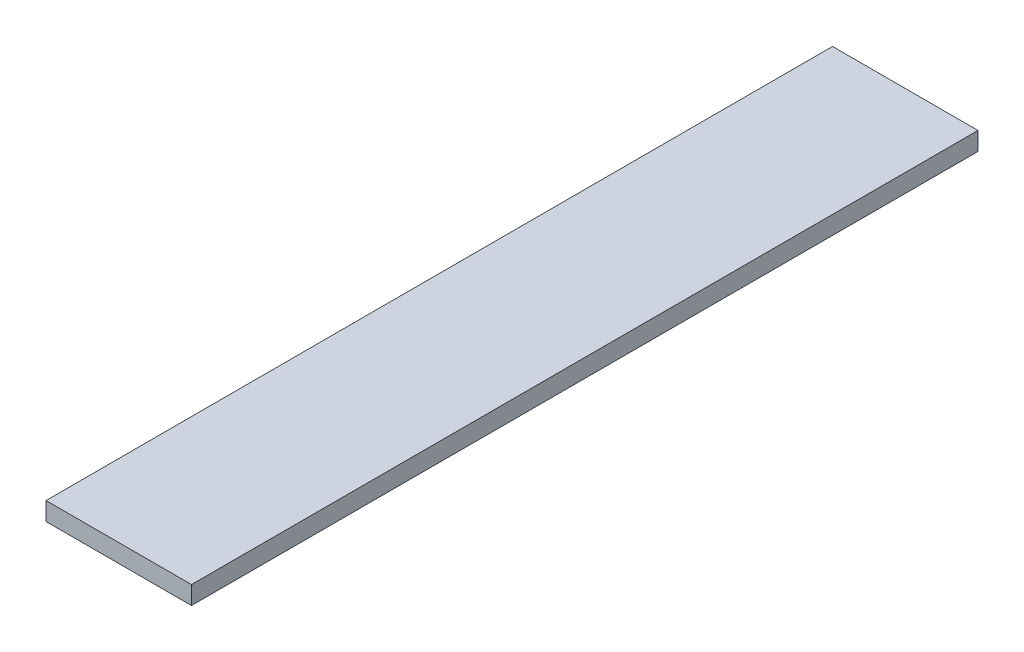
ISO-10303-21;
HEADER;
FILE_DESCRIPTION(('STEP AP214'),'2;1');
FILE_NAME('part.step','',(''),(''),'','','');
FILE_SCHEMA(('AUTOMOTIVE_DESIGN { 1 0 10303 214 1 1 1 1 }'));
ENDSEC;
DATA;
#1=APPLICATION_CONTEXT('core data for automotive mechanical design processes');
#2=APPLICATION_PROTOCOL_DEFINITION('international standard','automotive_design',2000,#1);
#3=PRODUCT_CONTEXT('',#1,'mechanical');
#4=PRODUCT('Part','Part','',(#3));
#5=PRODUCT_RELATED_PRODUCT_CATEGORY('part','',(#4));
#6=PRODUCT_DEFINITION_FORMATION('','',#4);
#7=PRODUCT_DEFINITION_CONTEXT('part definition',#1,'design');
#8=PRODUCT_DEFINITION('design','',#6,#7);
#9=PRODUCT_DEFINITION_SHAPE('','',#8);
#10=(LENGTH_UNIT() NAMED_UNIT(*) SI_UNIT(.MILLI.,.METRE.));
#11=(NAMED_UNIT(*) PLANE_ANGLE_UNIT() SI_UNIT($,.RADIAN.));
#12=(NAMED_UNIT(*) SI_UNIT($,.STERADIAN.) SOLID_ANGLE_UNIT());
#13=UNCERTAINTY_MEASURE_WITH_UNIT(LENGTH_MEASURE(1.E-05),#10,'distance_accuracy_value','');
#14=(GEOMETRIC_REPRESENTATION_CONTEXT(3) GLOBAL_UNCERTAINTY_ASSIGNED_CONTEXT((#13)) GLOBAL_UNIT_ASSIGNED_CONTEXT((#10,
#11,#12)) REPRESENTATION_CONTEXT('',''));
#15=CARTESIAN_POINT('',(0.,0.,0.));
#16=DIRECTION('',(0.,0.,1.));
#17=DIRECTION('',(1.,0.,0.));
#18=AXIS2_PLACEMENT_3D('',#15,#16,#17);
#19=CARTESIAN_POINT('',(101.6,12.7,0.));
#20=DIRECTION('',(0.,1.,0.));
#21=DIRECTION('',(0.,0.,1.));
#22=AXIS2_PLACEMENT_3D('',#19,#20,#21);
#23=PLANE('',#22);
#24=DIRECTION('',(0.,0.,-1.));
#25=VECTOR('',#24,1.);
#26=CARTESIAN_POINT('',(101.6,12.7,0.));
#27=LINE('',#26,#25);
#28=CARTESIAN_POINT('',(101.6,12.7,0.));
#29=VERTEX_POINT('',#28);
#30=CARTESIAN_POINT('',(101.6,12.7,549.275));
#31=VERTEX_POINT('',#30);
#32=EDGE_CURVE('E19',#29,#31,#27,.F.);
#33=ORIENTED_EDGE('',*,*,#32,.F.);
#34=DIRECTION('',(1.,0.,0.));
#35=VECTOR('',#34,1.);
#36=CARTESIAN_POINT('',(0.,12.7,0.));
#37=LINE('',#36,#35);
#38=CARTESIAN_POINT('',(0.,12.7,0.));
#39=VERTEX_POINT('',#38);
#40=EDGE_CURVE('E79',#29,#39,#37,.F.);
#41=ORIENTED_EDGE('',*,*,#40,.T.);
#42=DIRECTION('',(0.,0.,1.));
#43=VECTOR('',#42,1.);
#44=CARTESIAN_POINT('',(0.,12.7,0.));
#45=LINE('',#44,#43);
#46=CARTESIAN_POINT('',(0.,12.7,549.275));
#47=VERTEX_POINT('',#46);
#48=EDGE_CURVE('E67',#47,#39,#45,.F.);
#49=ORIENTED_EDGE('',*,*,#48,.F.);
#50=DIRECTION('',(1.,0.,0.));
#51=VECTOR('',#50,1.);
#52=CARTESIAN_POINT('',(0.,12.7,549.275));
#53=LINE('',#52,#51);
#54=EDGE_CURVE('E55',#31,#47,#53,.F.);
#55=ORIENTED_EDGE('',*,*,#54,.F.);
#56=EDGE_LOOP('',(#33,#41,#49,#55));
#57=FACE_BOUND('',#56,.T.);
#58=ADVANCED_FACE('F16',(#57),#23,.T.);
#59=CARTESIAN_POINT('',(101.6,0.,0.));
#60=DIRECTION('',(1.,0.,0.));
#61=DIRECTION('',(0.,0.,-1.));
#62=AXIS2_PLACEMENT_3D('',#59,#60,#61);
#63=PLANE('',#62);
#64=DIRECTION('',(0.,0.,-1.));
#65=VECTOR('',#64,1.);
#66=CARTESIAN_POINT('',(101.6,0.,0.));
#67=LINE('',#66,#65);
#68=CARTESIAN_POINT('',(101.6,0.,0.));
#69=VERTEX_POINT('',#68);
#70=CARTESIAN_POINT('',(101.6,0.,549.275));
#71=VERTEX_POINT('',#70);
#72=EDGE_CURVE('E82',#69,#71,#67,.F.);
#73=ORIENTED_EDGE('',*,*,#72,.F.);
#74=DIRECTION('',(0.,1.,0.));
#75=VECTOR('',#74,1.);
#76=CARTESIAN_POINT('',(101.6,0.,0.));
#77=LINE('',#76,#75);
#78=EDGE_CURVE('E64',#69,#29,#77,.T.);
#79=ORIENTED_EDGE('',*,*,#78,.T.);
#80=ORIENTED_EDGE('',*,*,#32,.T.);
#81=DIRECTION('',(0.,1.,0.));
#82=VECTOR('',#81,1.);
#83=CARTESIAN_POINT('',(101.6,0.,549.275));
#84=LINE('',#83,#82);
#85=EDGE_CURVE('E61',#71,#31,#84,.T.);
#86=ORIENTED_EDGE('',*,*,#85,.F.);
#87=EDGE_LOOP('',(#73,#79,#80,#86));
#88=FACE_BOUND('',#87,.T.);
#89=ADVANCED_FACE('F60',(#88),#63,.T.);
#90=CARTESIAN_POINT('',(0.,0.,549.275));
#91=DIRECTION('',(0.,0.,1.));
#92=DIRECTION('',(1.,0.,0.));
#93=AXIS2_PLACEMENT_3D('',#90,#91,#92);
#94=PLANE('',#93);
#95=DIRECTION('',(0.,1.,0.));
#96=VECTOR('',#95,1.);
#97=CARTESIAN_POINT('',(0.,12.7,549.275));
#98=LINE('',#97,#96);
#99=CARTESIAN_POINT('',(0.,0.,549.275));
#100=VERTEX_POINT('',#99);
#101=EDGE_CURVE('E69',#100,#47,#98,.T.);
#102=ORIENTED_EDGE('',*,*,#101,.F.);
#103=DIRECTION('',(1.,0.,0.));
#104=VECTOR('',#103,1.);
#105=CARTESIAN_POINT('',(0.,0.,549.275));
#106=LINE('',#105,#104);
#107=EDGE_CURVE('E73',#71,#100,#106,.F.);
#108=ORIENTED_EDGE('',*,*,#107,.F.);
#109=ORIENTED_EDGE('',*,*,#85,.T.);
#110=ORIENTED_EDGE('',*,*,#54,.T.);
#111=EDGE_LOOP('',(#102,#108,#109,#110));
#112=FACE_BOUND('',#111,.T.);
#113=ADVANCED_FACE('F71',(#112),#94,.T.);
#114=CARTESIAN_POINT('',(0.,12.7,0.));
#115=DIRECTION('',(-1.,0.,0.));
#116=DIRECTION('',(0.,0.,1.));
#117=AXIS2_PLACEMENT_3D('',#114,#115,#116);
#118=PLANE('',#117);
#119=ORIENTED_EDGE('',*,*,#48,.T.);
#120=DIRECTION('',(0.,1.,0.));
#121=VECTOR('',#120,1.);
#122=CARTESIAN_POINT('',(0.,0.,0.));
#123=LINE('',#122,#121);
#124=CARTESIAN_POINT('',(0.,0.,0.));
#125=VERTEX_POINT('',#124);
#126=EDGE_CURVE('E34',#39,#125,#123,.F.);
#127=ORIENTED_EDGE('',*,*,#126,.T.);
#128=DIRECTION('',(0.,0.,-1.));
#129=VECTOR('',#128,1.);
#130=CARTESIAN_POINT('',(0.,0.,0.));
#131=LINE('',#130,#129);
#132=EDGE_CURVE('E25',#100,#125,#131,.T.);
#133=ORIENTED_EDGE('',*,*,#132,.F.);
#134=ORIENTED_EDGE('',*,*,#101,.T.);
#135=EDGE_LOOP('',(#119,#127,#133,#134));
#136=FACE_BOUND('',#135,.T.);
#137=ADVANCED_FACE('F88',(#136),#118,.T.);
#138=CARTESIAN_POINT('',(0.,0.,0.));
#139=DIRECTION('',(0.,0.,1.));
#140=DIRECTION('',(1.,0.,0.));
#141=AXIS2_PLACEMENT_3D('',#138,#139,#140);
#142=PLANE('',#141);
#143=ORIENTED_EDGE('',*,*,#40,.F.);
#144=ORIENTED_EDGE('',*,*,#78,.F.);
#145=DIRECTION('',(1.,0.,0.));
#146=VECTOR('',#145,1.);
#147=CARTESIAN_POINT('',(0.,0.,0.));
#148=LINE('',#147,#146);
#149=EDGE_CURVE('E11',#125,#69,#148,.T.);
#150=ORIENTED_EDGE('',*,*,#149,.F.);
#151=ORIENTED_EDGE('',*,*,#126,.F.);
#152=EDGE_LOOP('',(#143,#144,#150,#151));
#153=FACE_BOUND('',#152,.T.);
#154=ADVANCED_FACE('F90',(#153),#142,.F.);
#155=CARTESIAN_POINT('',(0.,0.,0.));
#156=DIRECTION('',(0.,-1.,0.));
#157=DIRECTION('',(0.,0.,-1.));
#158=AXIS2_PLACEMENT_3D('',#155,#156,#157);
#159=PLANE('',#158);
#160=ORIENTED_EDGE('',*,*,#132,.T.);
#161=ORIENTED_EDGE('',*,*,#149,.T.);
#162=ORIENTED_EDGE('',*,*,#72,.T.);
#163=ORIENTED_EDGE('',*,*,#107,.T.);
#164=EDGE_LOOP('',(#160,#161,#162,#163));
#165=FACE_BOUND('',#164,.T.);
#166=ADVANCED_FACE('F87',(#165),#159,.T.);
#167=CLOSED_SHELL('',(#58,#89,#113,#137,#154,#166));
#168=MANIFOLD_SOLID_BREP('B1',#167);
#169=ADVANCED_BREP_SHAPE_REPRESENTATION('',(#18,#168),#14);
#170=SHAPE_DEFINITION_REPRESENTATION(#9,#169);
ENDSEC;
END-ISO-10303-21;
